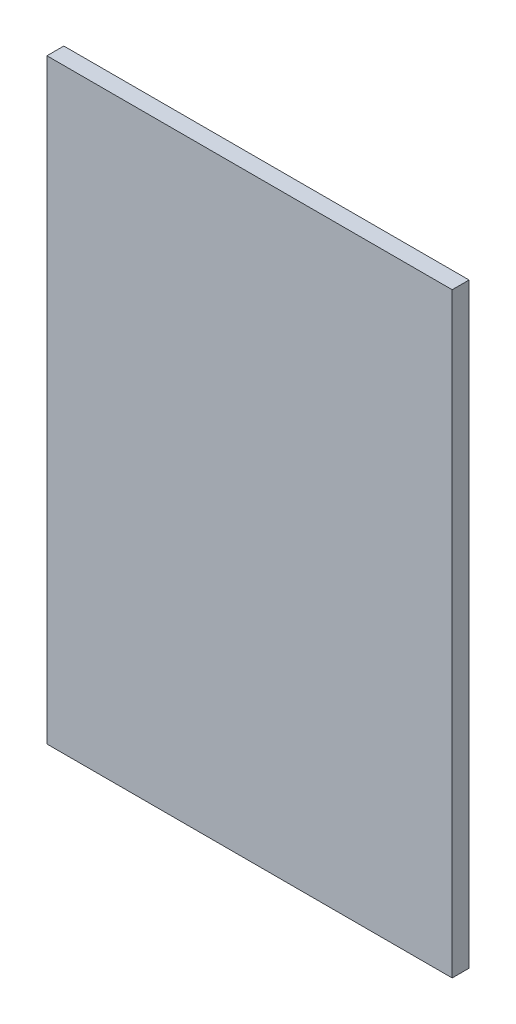
ISO-10303-21;
HEADER;
FILE_DESCRIPTION(('STEP AP214'),'2;1');
FILE_NAME('part.step','',(''),(''),'','','');
FILE_SCHEMA(('AUTOMOTIVE_DESIGN { 1 0 10303 214 1 1 1 1 }'));
ENDSEC;
DATA;
#1=APPLICATION_CONTEXT('core data for automotive mechanical design processes');
#2=APPLICATION_PROTOCOL_DEFINITION('international standard','automotive_design',2000,#1);
#3=PRODUCT_CONTEXT('',#1,'mechanical');
#4=PRODUCT('Part','Part','',(#3));
#5=PRODUCT_RELATED_PRODUCT_CATEGORY('part','',(#4));
#6=PRODUCT_DEFINITION_FORMATION('','',#4);
#7=PRODUCT_DEFINITION_CONTEXT('part definition',#1,'design');
#8=PRODUCT_DEFINITION('design','',#6,#7);
#9=PRODUCT_DEFINITION_SHAPE('','',#8);
#10=(LENGTH_UNIT() NAMED_UNIT(*) SI_UNIT(.MILLI.,.METRE.));
#11=(NAMED_UNIT(*) PLANE_ANGLE_UNIT() SI_UNIT($,.RADIAN.));
#12=(NAMED_UNIT(*) SI_UNIT($,.STERADIAN.) SOLID_ANGLE_UNIT());
#13=UNCERTAINTY_MEASURE_WITH_UNIT(LENGTH_MEASURE(1.E-05),#10,'distance_accuracy_value','');
#14=(GEOMETRIC_REPRESENTATION_CONTEXT(3) GLOBAL_UNCERTAINTY_ASSIGNED_CONTEXT((#13)) GLOBAL_UNIT_ASSIGNED_CONTEXT((#10,
#11,#12)) REPRESENTATION_CONTEXT('',''));
#15=CARTESIAN_POINT('',(0.,0.,0.));
#16=DIRECTION('',(0.,0.,1.));
#17=DIRECTION('',(1.,0.,0.));
#18=AXIS2_PLACEMENT_3D('',#15,#16,#17);
#19=CARTESIAN_POINT('',(0.,0.,0.));
#20=DIRECTION('',(0.,0.,-1.));
#21=DIRECTION('',(-1.,0.,0.));
#22=AXIS2_PLACEMENT_3D('',#19,#20,#21);
#23=PLANE('',#22);
#24=DIRECTION('',(-1.,0.,0.));
#25=VECTOR('',#24,1.);
#26=CARTESIAN_POINT('',(60.,86.5,0.));
#27=LINE('',#26,#25);
#28=CARTESIAN_POINT('',(60.,86.5,0.));
#29=VERTEX_POINT('',#28);
#30=CARTESIAN_POINT('',(-60.,86.5,0.));
#31=VERTEX_POINT('',#30);
#32=EDGE_CURVE('E130',#29,#31,#27,.T.);
#33=ORIENTED_EDGE('',*,*,#32,.F.);
#34=DIRECTION('',(0.,1.,0.));
#35=VECTOR('',#34,1.);
#36=CARTESIAN_POINT('',(60.,-90.,0.));
#37=LINE('',#36,#35);
#38=CARTESIAN_POINT('',(60.,-90.,0.));
#39=VERTEX_POINT('',#38);
#40=EDGE_CURVE('E142',#39,#29,#37,.T.);
#41=ORIENTED_EDGE('',*,*,#40,.F.);
#42=DIRECTION('',(1.,0.,0.));
#43=VECTOR('',#42,1.);
#44=CARTESIAN_POINT('',(-60.,-90.,0.));
#45=LINE('',#44,#43);
#46=CARTESIAN_POINT('',(-60.,-90.,0.));
#47=VERTEX_POINT('',#46);
#48=EDGE_CURVE('E154',#47,#39,#45,.T.);
#49=ORIENTED_EDGE('',*,*,#48,.F.);
#50=DIRECTION('',(0.,-1.,0.));
#51=VECTOR('',#50,1.);
#52=CARTESIAN_POINT('',(-60.,-90.,0.));
#53=LINE('',#52,#51);
#54=EDGE_CURVE('E143',#31,#47,#53,.T.);
#55=ORIENTED_EDGE('',*,*,#54,.F.);
#56=EDGE_LOOP('',(#33,#41,#49,#55));
#57=FACE_BOUND('',#56,.T.);
#58=DIRECTION('',(1.,0.,0.));
#59=VECTOR('',#58,1.);
#60=CARTESIAN_POINT('',(7.00000000000001,70.,0.));
#61=LINE('',#60,#59);
#62=CARTESIAN_POINT('',(7.00000000000001,70.,0.));
#63=VERTEX_POINT('',#62);
#64=CARTESIAN_POINT('',(15.,70.,0.));
#65=VERTEX_POINT('',#64);
#66=EDGE_CURVE('E237',#63,#65,#61,.T.);
#67=ORIENTED_EDGE('',*,*,#66,.F.);
#68=DIRECTION('',(0.,1.,0.));
#69=VECTOR('',#68,1.);
#70=CARTESIAN_POINT('',(7.00000000000001,70.,0.));
#71=LINE('',#70,#69);
#72=CARTESIAN_POINT('',(6.99999999999999,-70.,0.));
#73=VERTEX_POINT('',#72);
#74=EDGE_CURVE('E218',#73,#63,#71,.T.);
#75=ORIENTED_EDGE('',*,*,#74,.F.);
#76=DIRECTION('',(-1.,0.,0.));
#77=VECTOR('',#76,1.);
#78=CARTESIAN_POINT('',(6.99999999999999,-70.,0.));
#79=LINE('',#78,#77);
#80=CARTESIAN_POINT('',(15.,-70.,0.));
#81=VERTEX_POINT('',#80);
#82=EDGE_CURVE('E224',#81,#73,#79,.T.);
#83=ORIENTED_EDGE('',*,*,#82,.F.);
#84=DIRECTION('',(0.,-1.,0.));
#85=VECTOR('',#84,1.);
#86=CARTESIAN_POINT('',(15.,70.,0.));
#87=LINE('',#86,#85);
#88=EDGE_CURVE('E240',#65,#81,#87,.T.);
#89=ORIENTED_EDGE('',*,*,#88,.F.);
#90=EDGE_LOOP('',(#67,#75,#83,#89));
#91=FACE_BOUND('',#90,.T.);
#92=DIRECTION('',(-1.,0.,0.));
#93=VECTOR('',#92,1.);
#94=CARTESIAN_POINT('',(-7.00000000000001,-70.,0.));
#95=LINE('',#94,#93);
#96=CARTESIAN_POINT('',(-7.00000000000001,-70.,0.));
#97=VERTEX_POINT('',#96);
#98=CARTESIAN_POINT('',(-15.,-70.,0.));
#99=VERTEX_POINT('',#98);
#100=EDGE_CURVE('E181',#97,#99,#95,.T.);
#101=ORIENTED_EDGE('',*,*,#100,.F.);
#102=DIRECTION('',(0.,-1.,0.));
#103=VECTOR('',#102,1.);
#104=CARTESIAN_POINT('',(-6.99999999999999,70.,0.));
#105=LINE('',#104,#103);
#106=CARTESIAN_POINT('',(-6.99999999999999,70.,0.));
#107=VERTEX_POINT('',#106);
#108=EDGE_CURVE('E177',#107,#97,#105,.T.);
#109=ORIENTED_EDGE('',*,*,#108,.F.);
#110=DIRECTION('',(1.,0.,0.));
#111=VECTOR('',#110,1.);
#112=CARTESIAN_POINT('',(-6.99999999999999,70.,0.));
#113=LINE('',#112,#111);
#114=CARTESIAN_POINT('',(-15.,70.,0.));
#115=VERTEX_POINT('',#114);
#116=EDGE_CURVE('E189',#115,#107,#113,.T.);
#117=ORIENTED_EDGE('',*,*,#116,.F.);
#118=DIRECTION('',(0.,1.,0.));
#119=VECTOR('',#118,1.);
#120=CARTESIAN_POINT('',(-15.,70.,0.));
#121=LINE('',#120,#119);
#122=EDGE_CURVE('E201',#99,#115,#121,.T.);
#123=ORIENTED_EDGE('',*,*,#122,.F.);
#124=EDGE_LOOP('',(#101,#109,#117,#123));
#125=FACE_BOUND('',#124,.T.);
#126=ADVANCED_FACE('F39',(#57,#91,#125),#23,.T.);
#127=CARTESIAN_POINT('',(60.,-90.,5.));
#128=DIRECTION('',(-1.,0.,0.));
#129=DIRECTION('',(0.,0.,1.));
#130=AXIS2_PLACEMENT_3D('',#127,#128,#129);
#131=PLANE('',#130);
#132=ORIENTED_EDGE('',*,*,#40,.T.);
#133=DIRECTION('',(0.,0.,-1.));
#134=VECTOR('',#133,1.);
#135=CARTESIAN_POINT('',(60.,86.5,10.));
#136=LINE('',#135,#134);
#137=CARTESIAN_POINT('',(60.,86.5,5.));
#138=VERTEX_POINT('',#137);
#139=EDGE_CURVE('E127',#138,#29,#136,.T.);
#140=ORIENTED_EDGE('',*,*,#139,.F.);
#141=DIRECTION('',(0.,1.,0.));
#142=VECTOR('',#141,1.);
#143=CARTESIAN_POINT('',(60.,-90.,5.));
#144=LINE('',#143,#142);
#145=CARTESIAN_POINT('',(60.,-90.,5.));
#146=VERTEX_POINT('',#145);
#147=EDGE_CURVE('E164',#146,#138,#144,.T.);
#148=ORIENTED_EDGE('',*,*,#147,.F.);
#149=DIRECTION('',(0.,0.,-1.));
#150=VECTOR('',#149,1.);
#151=CARTESIAN_POINT('',(60.,-90.,5.));
#152=LINE('',#151,#150);
#153=EDGE_CURVE('E148',#146,#39,#152,.T.);
#154=ORIENTED_EDGE('',*,*,#153,.T.);
#155=EDGE_LOOP('',(#132,#140,#148,#154));
#156=FACE_BOUND('',#155,.T.);
#157=ADVANCED_FACE('F41',(#156),#131,.F.);
#158=CARTESIAN_POINT('',(-60.,-90.,5.));
#159=DIRECTION('',(1.,0.,0.));
#160=DIRECTION('',(0.,0.,-1.));
#161=AXIS2_PLACEMENT_3D('',#158,#159,#160);
#162=PLANE('',#161);
#163=DIRECTION('',(0.,-1.,0.));
#164=VECTOR('',#163,1.);
#165=CARTESIAN_POINT('',(-60.,-90.,5.));
#166=LINE('',#165,#164);
#167=CARTESIAN_POINT('',(-60.,86.5,5.));
#168=VERTEX_POINT('',#167);
#169=CARTESIAN_POINT('',(-60.,-90.,5.));
#170=VERTEX_POINT('',#169);
#171=EDGE_CURVE('E175',#168,#170,#166,.T.);
#172=ORIENTED_EDGE('',*,*,#171,.F.);
#173=DIRECTION('',(0.,0.,-1.));
#174=VECTOR('',#173,1.);
#175=CARTESIAN_POINT('',(-60.,86.5,10.));
#176=LINE('',#175,#174);
#177=EDGE_CURVE('E55',#168,#31,#176,.T.);
#178=ORIENTED_EDGE('',*,*,#177,.T.);
#179=ORIENTED_EDGE('',*,*,#54,.T.);
#180=DIRECTION('',(0.,0.,-1.));
#181=VECTOR('',#180,1.);
#182=CARTESIAN_POINT('',(-60.,-90.,5.));
#183=LINE('',#182,#181);
#184=EDGE_CURVE('E48',#170,#47,#183,.T.);
#185=ORIENTED_EDGE('',*,*,#184,.F.);
#186=EDGE_LOOP('',(#172,#178,#179,#185));
#187=FACE_BOUND('',#186,.T.);
#188=ADVANCED_FACE('F174',(#187),#162,.F.);
#189=CARTESIAN_POINT('',(-60.,-90.,5.));
#190=DIRECTION('',(0.,1.,0.));
#191=DIRECTION('',(0.,0.,1.));
#192=AXIS2_PLACEMENT_3D('',#189,#190,#191);
#193=PLANE('',#192);
#194=ORIENTED_EDGE('',*,*,#48,.T.);
#195=ORIENTED_EDGE('',*,*,#153,.F.);
#196=DIRECTION('',(1.,0.,0.));
#197=VECTOR('',#196,1.);
#198=CARTESIAN_POINT('',(-60.,-90.,5.));
#199=LINE('',#198,#197);
#200=EDGE_CURVE('E159',#170,#146,#199,.T.);
#201=ORIENTED_EDGE('',*,*,#200,.F.);
#202=ORIENTED_EDGE('',*,*,#184,.T.);
#203=EDGE_LOOP('',(#194,#195,#201,#202));
#204=FACE_BOUND('',#203,.T.);
#205=ADVANCED_FACE('F171',(#204),#193,.F.);
#206=CARTESIAN_POINT('',(0.,0.,5.));
#207=DIRECTION('',(0.,0.,-1.));
#208=DIRECTION('',(-1.,0.,0.));
#209=AXIS2_PLACEMENT_3D('',#206,#207,#208);
#210=PLANE('',#209);
#211=ORIENTED_EDGE('',*,*,#147,.T.);
#212=DIRECTION('',(-1.,0.,0.));
#213=VECTOR('',#212,1.);
#214=CARTESIAN_POINT('',(0.,86.5,5.));
#215=LINE('',#214,#213);
#216=EDGE_CURVE('E11',#138,#168,#215,.T.);
#217=ORIENTED_EDGE('',*,*,#216,.T.);
#218=ORIENTED_EDGE('',*,*,#171,.T.);
#219=ORIENTED_EDGE('',*,*,#200,.T.);
#220=EDGE_LOOP('',(#211,#217,#218,#219));
#221=FACE_BOUND('',#220,.T.);
#222=ADVANCED_FACE('F259',(#221),#210,.F.);
#223=CARTESIAN_POINT('',(7.00000000000001,70.,-14.));
#224=DIRECTION('',(1.,0.,0.));
#225=DIRECTION('',(0.,1.,0.));
#226=AXIS2_PLACEMENT_3D('',#223,#224,#225);
#227=PLANE('',#226);
#228=ORIENTED_EDGE('',*,*,#74,.T.);
#229=DIRECTION('',(0.,0.,1.));
#230=VECTOR('',#229,1.);
#231=CARTESIAN_POINT('',(7.00000000000001,70.,-14.));
#232=LINE('',#231,#230);
#233=CARTESIAN_POINT('',(7.00000000000001,70.,-14.));
#234=VERTEX_POINT('',#233);
#235=EDGE_CURVE('E150',#234,#63,#232,.T.);
#236=ORIENTED_EDGE('',*,*,#235,.F.);
#237=DIRECTION('',(0.,1.,0.));
#238=VECTOR('',#237,1.);
#239=CARTESIAN_POINT('',(7.00000000000001,70.,-14.));
#240=LINE('',#239,#238);
#241=CARTESIAN_POINT('',(6.99999999999999,-70.,-14.));
#242=VERTEX_POINT('',#241);
#243=EDGE_CURVE('E219',#242,#234,#240,.T.);
#244=ORIENTED_EDGE('',*,*,#243,.F.);
#245=DIRECTION('',(0.,0.,1.));
#246=VECTOR('',#245,1.);
#247=CARTESIAN_POINT('',(6.99999999999999,-70.,-14.));
#248=LINE('',#247,#246);
#249=EDGE_CURVE('E233',#242,#73,#248,.T.);
#250=ORIENTED_EDGE('',*,*,#249,.T.);
#251=EDGE_LOOP('',(#228,#236,#244,#250));
#252=FACE_BOUND('',#251,.T.);
#253=ADVANCED_FACE('F261',(#252),#227,.F.);
#254=CARTESIAN_POINT('',(7.00000000000001,70.,-14.));
#255=DIRECTION('',(0.,-1.,0.));
#256=DIRECTION('',(0.,0.,-1.));
#257=AXIS2_PLACEMENT_3D('',#254,#255,#256);
#258=PLANE('',#257);
#259=ORIENTED_EDGE('',*,*,#66,.T.);
#260=DIRECTION('',(0.,0.,1.));
#261=VECTOR('',#260,1.);
#262=CARTESIAN_POINT('',(15.,70.,-14.));
#263=LINE('',#262,#261);
#264=CARTESIAN_POINT('',(15.,70.,-14.));
#265=VERTEX_POINT('',#264);
#266=EDGE_CURVE('E156',#265,#65,#263,.T.);
#267=ORIENTED_EDGE('',*,*,#266,.F.);
#268=DIRECTION('',(1.,0.,0.));
#269=VECTOR('',#268,1.);
#270=CARTESIAN_POINT('',(7.00000000000001,70.,-14.));
#271=LINE('',#270,#269);
#272=EDGE_CURVE('E223',#234,#265,#271,.T.);
#273=ORIENTED_EDGE('',*,*,#272,.F.);
#274=ORIENTED_EDGE('',*,*,#235,.T.);
#275=EDGE_LOOP('',(#259,#267,#273,#274));
#276=FACE_BOUND('',#275,.T.);
#277=ADVANCED_FACE('F267',(#276),#258,.F.);
#278=CARTESIAN_POINT('',(15.,70.,-14.));
#279=DIRECTION('',(-1.,0.,0.));
#280=DIRECTION('',(0.,-1.,0.));
#281=AXIS2_PLACEMENT_3D('',#278,#279,#280);
#282=PLANE('',#281);
#283=ORIENTED_EDGE('',*,*,#88,.T.);
#284=DIRECTION('',(0.,0.,1.));
#285=VECTOR('',#284,1.);
#286=CARTESIAN_POINT('',(15.,-70.,-14.));
#287=LINE('',#286,#285);
#288=CARTESIAN_POINT('',(15.,-70.,-14.));
#289=VERTEX_POINT('',#288);
#290=EDGE_CURVE('E249',#289,#81,#287,.T.);
#291=ORIENTED_EDGE('',*,*,#290,.F.);
#292=DIRECTION('',(0.,-1.,0.));
#293=VECTOR('',#292,1.);
#294=CARTESIAN_POINT('',(15.,70.,-14.));
#295=LINE('',#294,#293);
#296=EDGE_CURVE('E227',#265,#289,#295,.T.);
#297=ORIENTED_EDGE('',*,*,#296,.F.);
#298=ORIENTED_EDGE('',*,*,#266,.T.);
#299=EDGE_LOOP('',(#283,#291,#297,#298));
#300=FACE_BOUND('',#299,.T.);
#301=ADVANCED_FACE('F302',(#300),#282,.F.);
#302=CARTESIAN_POINT('',(6.99999999999999,-70.,-14.));
#303=DIRECTION('',(0.,1.,0.));
#304=DIRECTION('',(0.,0.,1.));
#305=AXIS2_PLACEMENT_3D('',#302,#303,#304);
#306=PLANE('',#305);
#307=ORIENTED_EDGE('',*,*,#82,.T.);
#308=ORIENTED_EDGE('',*,*,#249,.F.);
#309=DIRECTION('',(-1.,0.,0.));
#310=VECTOR('',#309,1.);
#311=CARTESIAN_POINT('',(6.99999999999999,-70.,-14.));
#312=LINE('',#311,#310);
#313=EDGE_CURVE('E230',#289,#242,#312,.T.);
#314=ORIENTED_EDGE('',*,*,#313,.F.);
#315=ORIENTED_EDGE('',*,*,#290,.T.);
#316=EDGE_LOOP('',(#307,#308,#314,#315));
#317=FACE_BOUND('',#316,.T.);
#318=ADVANCED_FACE('F312',(#317),#306,.F.);
#319=CARTESIAN_POINT('',(0.,0.,-14.));
#320=DIRECTION('',(0.,0.,1.));
#321=DIRECTION('',(1.,0.,0.));
#322=AXIS2_PLACEMENT_3D('',#319,#320,#321);
#323=PLANE('',#322);
#324=ORIENTED_EDGE('',*,*,#243,.T.);
#325=ORIENTED_EDGE('',*,*,#272,.T.);
#326=ORIENTED_EDGE('',*,*,#296,.T.);
#327=ORIENTED_EDGE('',*,*,#313,.T.);
#328=EDGE_LOOP('',(#324,#325,#326,#327));
#329=FACE_BOUND('',#328,.T.);
#330=ADVANCED_FACE('F322',(#329),#323,.F.);
#331=CARTESIAN_POINT('',(-6.99999999999999,70.,-14.));
#332=DIRECTION('',(-1.,0.,0.));
#333=DIRECTION('',(0.,-1.,0.));
#334=AXIS2_PLACEMENT_3D('',#331,#332,#333);
#335=PLANE('',#334);
#336=ORIENTED_EDGE('',*,*,#108,.T.);
#337=DIRECTION('',(0.,0.,1.));
#338=VECTOR('',#337,1.);
#339=CARTESIAN_POINT('',(-7.00000000000001,-70.,-14.));
#340=LINE('',#339,#338);
#341=CARTESIAN_POINT('',(-7.00000000000001,-70.,-14.));
#342=VERTEX_POINT('',#341);
#343=EDGE_CURVE('E215',#342,#97,#340,.T.);
#344=ORIENTED_EDGE('',*,*,#343,.F.);
#345=DIRECTION('',(0.,-1.,0.));
#346=VECTOR('',#345,1.);
#347=CARTESIAN_POINT('',(-6.99999999999999,70.,-14.));
#348=LINE('',#347,#346);
#349=CARTESIAN_POINT('',(-6.99999999999999,70.,-14.));
#350=VERTEX_POINT('',#349);
#351=EDGE_CURVE('E184',#350,#342,#348,.T.);
#352=ORIENTED_EDGE('',*,*,#351,.F.);
#353=DIRECTION('',(0.,0.,1.));
#354=VECTOR('',#353,1.);
#355=CARTESIAN_POINT('',(-6.99999999999999,70.,-14.));
#356=LINE('',#355,#354);
#357=EDGE_CURVE('E197',#350,#107,#356,.T.);
#358=ORIENTED_EDGE('',*,*,#357,.T.);
#359=EDGE_LOOP('',(#336,#344,#352,#358));
#360=FACE_BOUND('',#359,.T.);
#361=ADVANCED_FACE('F332',(#360),#335,.F.);
#362=CARTESIAN_POINT('',(-7.00000000000001,-70.,-14.));
#363=DIRECTION('',(0.,1.,0.));
#364=DIRECTION('',(0.,0.,1.));
#365=AXIS2_PLACEMENT_3D('',#362,#363,#364);
#366=PLANE('',#365);
#367=ORIENTED_EDGE('',*,*,#100,.T.);
#368=DIRECTION('',(0.,0.,1.));
#369=VECTOR('',#368,1.);
#370=CARTESIAN_POINT('',(-15.,-70.,-14.));
#371=LINE('',#370,#369);
#372=CARTESIAN_POINT('',(-15.,-70.,-14.));
#373=VERTEX_POINT('',#372);
#374=EDGE_CURVE('E211',#373,#99,#371,.T.);
#375=ORIENTED_EDGE('',*,*,#374,.F.);
#376=DIRECTION('',(-1.,0.,0.));
#377=VECTOR('',#376,1.);
#378=CARTESIAN_POINT('',(-7.00000000000001,-70.,-14.));
#379=LINE('',#378,#377);
#380=EDGE_CURVE('E188',#342,#373,#379,.T.);
#381=ORIENTED_EDGE('',*,*,#380,.F.);
#382=ORIENTED_EDGE('',*,*,#343,.T.);
#383=EDGE_LOOP('',(#367,#375,#381,#382));
#384=FACE_BOUND('',#383,.T.);
#385=ADVANCED_FACE('F342',(#384),#366,.F.);
#386=CARTESIAN_POINT('',(-15.,70.,-14.));
#387=DIRECTION('',(1.,0.,0.));
#388=DIRECTION('',(0.,1.,0.));
#389=AXIS2_PLACEMENT_3D('',#386,#387,#388);
#390=PLANE('',#389);
#391=ORIENTED_EDGE('',*,*,#122,.T.);
#392=DIRECTION('',(0.,0.,1.));
#393=VECTOR('',#392,1.);
#394=CARTESIAN_POINT('',(-15.,70.,-14.));
#395=LINE('',#394,#393);
#396=CARTESIAN_POINT('',(-15.,70.,-14.));
#397=VERTEX_POINT('',#396);
#398=EDGE_CURVE('E62',#397,#115,#395,.T.);
#399=ORIENTED_EDGE('',*,*,#398,.F.);
#400=DIRECTION('',(0.,1.,0.));
#401=VECTOR('',#400,1.);
#402=CARTESIAN_POINT('',(-15.,70.,-14.));
#403=LINE('',#402,#401);
#404=EDGE_CURVE('E192',#373,#397,#403,.T.);
#405=ORIENTED_EDGE('',*,*,#404,.F.);
#406=ORIENTED_EDGE('',*,*,#374,.T.);
#407=EDGE_LOOP('',(#391,#399,#405,#406));
#408=FACE_BOUND('',#407,.T.);
#409=ADVANCED_FACE('F352',(#408),#390,.F.);
#410=CARTESIAN_POINT('',(-6.99999999999999,70.,-14.));
#411=DIRECTION('',(0.,-1.,0.));
#412=DIRECTION('',(0.,0.,-1.));
#413=AXIS2_PLACEMENT_3D('',#410,#411,#412);
#414=PLANE('',#413);
#415=ORIENTED_EDGE('',*,*,#116,.T.);
#416=ORIENTED_EDGE('',*,*,#357,.F.);
#417=DIRECTION('',(1.,0.,0.));
#418=VECTOR('',#417,1.);
#419=CARTESIAN_POINT('',(-6.99999999999999,70.,-14.));
#420=LINE('',#419,#418);
#421=EDGE_CURVE('E195',#397,#350,#420,.T.);
#422=ORIENTED_EDGE('',*,*,#421,.F.);
#423=ORIENTED_EDGE('',*,*,#398,.T.);
#424=EDGE_LOOP('',(#415,#416,#422,#423));
#425=FACE_BOUND('',#424,.T.);
#426=ADVANCED_FACE('F362',(#425),#414,.F.);
#427=CARTESIAN_POINT('',(0.,0.,-14.));
#428=DIRECTION('',(0.,0.,-1.));
#429=DIRECTION('',(-1.,0.,0.));
#430=AXIS2_PLACEMENT_3D('',#427,#428,#429);
#431=PLANE('',#430);
#432=ORIENTED_EDGE('',*,*,#351,.T.);
#433=ORIENTED_EDGE('',*,*,#380,.T.);
#434=ORIENTED_EDGE('',*,*,#404,.T.);
#435=ORIENTED_EDGE('',*,*,#421,.T.);
#436=EDGE_LOOP('',(#432,#433,#434,#435));
#437=FACE_BOUND('',#436,.T.);
#438=ADVANCED_FACE('F372',(#437),#431,.T.);
#439=CARTESIAN_POINT('',(60.,86.5,10.));
#440=DIRECTION('',(0.,-1.,0.));
#441=DIRECTION('',(0.,0.,-1.));
#442=AXIS2_PLACEMENT_3D('',#439,#440,#441);
#443=PLANE('',#442);
#444=ORIENTED_EDGE('',*,*,#139,.T.);
#445=ORIENTED_EDGE('',*,*,#32,.T.);
#446=ORIENTED_EDGE('',*,*,#177,.F.);
#447=ORIENTED_EDGE('',*,*,#216,.F.);
#448=EDGE_LOOP('',(#444,#445,#446,#447));
#449=FACE_BOUND('',#448,.T.);
#450=ADVANCED_FACE('F129',(#449),#443,.F.);
#451=CLOSED_SHELL('',(#126,#157,#188,#205,#222,#253,#277,#301,#318,#330,#361,#385,#409,#426,
#438,#450));
#452=MANIFOLD_SOLID_BREP('B2',#451);
#453=ADVANCED_BREP_SHAPE_REPRESENTATION('',(#18,#452),#14);
#454=SHAPE_DEFINITION_REPRESENTATION(#9,#453);
ENDSEC;
END-ISO-10303-21;
